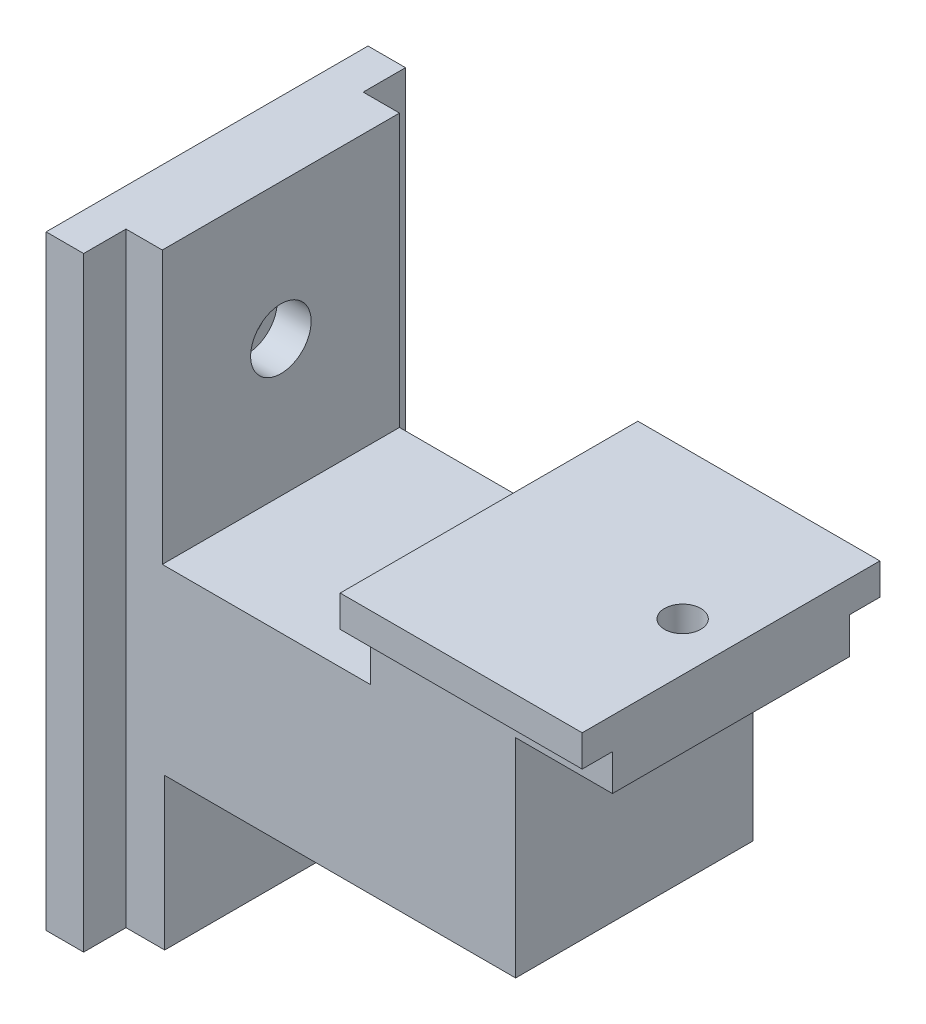
ISO-10303-21;
HEADER;
FILE_DESCRIPTION(('STEP AP214'),'2;1');
FILE_NAME('part.step','',(''),(''),'','','');
FILE_SCHEMA(('AUTOMOTIVE_DESIGN { 1 0 10303 214 1 1 1 1 }'));
ENDSEC;
DATA;
#1=APPLICATION_CONTEXT('core data for automotive mechanical design processes');
#2=APPLICATION_PROTOCOL_DEFINITION('international standard','automotive_design',2000,#1);
#3=PRODUCT_CONTEXT('',#1,'mechanical');
#4=PRODUCT('Part','Part','',(#3));
#5=PRODUCT_RELATED_PRODUCT_CATEGORY('part','',(#4));
#6=PRODUCT_DEFINITION_FORMATION('','',#4);
#7=PRODUCT_DEFINITION_CONTEXT('part definition',#1,'design');
#8=PRODUCT_DEFINITION('design','',#6,#7);
#9=PRODUCT_DEFINITION_SHAPE('','',#8);
#10=(LENGTH_UNIT() NAMED_UNIT(*) SI_UNIT(.MILLI.,.METRE.));
#11=(NAMED_UNIT(*) PLANE_ANGLE_UNIT() SI_UNIT($,.RADIAN.));
#12=(NAMED_UNIT(*) SI_UNIT($,.STERADIAN.) SOLID_ANGLE_UNIT());
#13=UNCERTAINTY_MEASURE_WITH_UNIT(LENGTH_MEASURE(1.E-05),#10,'distance_accuracy_value','');
#14=(GEOMETRIC_REPRESENTATION_CONTEXT(3) GLOBAL_UNCERTAINTY_ASSIGNED_CONTEXT((#13)) GLOBAL_UNIT_ASSIGNED_CONTEXT((#10,
#11,#12)) REPRESENTATION_CONTEXT('',''));
#15=CARTESIAN_POINT('',(0.,0.,0.));
#16=DIRECTION('',(0.,0.,1.));
#17=DIRECTION('',(1.,0.,0.));
#18=AXIS2_PLACEMENT_3D('',#15,#16,#17);
#19=CARTESIAN_POINT('',(-39.7426406871193,18.75,0.));
#20=DIRECTION('',(1.,0.,0.));
#21=DIRECTION('',(0.,0.,-1.));
#22=AXIS2_PLACEMENT_3D('',#19,#20,#21);
#23=CYLINDRICAL_SURFACE('',#22,1.5);
#24=CARTESIAN_POINT('',(-35.3,18.75,0.));
#25=DIRECTION('',(-1.,0.,0.));
#26=DIRECTION('',(0.,0.,1.));
#27=AXIS2_PLACEMENT_3D('',#24,#25,#26);
#28=CIRCLE('',#27,1.5);
#29=CARTESIAN_POINT('',(-35.3,18.75,1.50000000000001));
#30=VERTEX_POINT('',#29);
#31=EDGE_CURVE('E44',#30,#30,#28,.F.);
#32=ORIENTED_EDGE('',*,*,#31,.F.);
#33=EDGE_LOOP('',(#32));
#34=FACE_BOUND('',#33,.T.);
#35=CARTESIAN_POINT('',(-32.,18.75,0.));
#36=DIRECTION('',(1.,0.,0.));
#37=DIRECTION('',(0.,0.,-1.));
#38=AXIS2_PLACEMENT_3D('',#35,#36,#37);
#39=CIRCLE('',#38,1.5);
#40=CARTESIAN_POINT('',(-32.,18.75,-1.5));
#41=VERTEX_POINT('',#40);
#42=EDGE_CURVE('E207',#41,#41,#39,.T.);
#43=ORIENTED_EDGE('',*,*,#42,.T.);
#44=EDGE_LOOP('',(#43));
#45=FACE_BOUND('',#44,.T.);
#46=ADVANCED_FACE('F40',(#34,#45),#23,.F.);
#47=CARTESIAN_POINT('',(4.00000000000001,30.,0.));
#48=DIRECTION('',(0.,-1.,0.));
#49=DIRECTION('',(1.,0.,0.));
#50=AXIS2_PLACEMENT_3D('',#47,#48,#49);
#51=CYLINDRICAL_SURFACE('',#50,1.5);
#52=CARTESIAN_POINT('',(4.,15.3,0.));
#53=DIRECTION('',(0.,1.,0.));
#54=DIRECTION('',(-1.,0.,0.));
#55=AXIS2_PLACEMENT_3D('',#52,#53,#54);
#56=CIRCLE('',#55,1.5);
#57=CARTESIAN_POINT('',(2.5,15.3,0.));
#58=VERTEX_POINT('',#57);
#59=EDGE_CURVE('E208',#58,#58,#56,.T.);
#60=ORIENTED_EDGE('',*,*,#59,.T.);
#61=EDGE_LOOP('',(#60));
#62=FACE_BOUND('',#61,.T.);
#63=CARTESIAN_POINT('',(4.,11.5,0.));
#64=DIRECTION('',(0.,-1.,0.));
#65=DIRECTION('',(1.,0.,0.));
#66=AXIS2_PLACEMENT_3D('',#63,#64,#65);
#67=CIRCLE('',#66,1.5);
#68=CARTESIAN_POINT('',(5.5,11.5,0.));
#69=VERTEX_POINT('',#68);
#70=EDGE_CURVE('E223',#69,#69,#67,.T.);
#71=ORIENTED_EDGE('',*,*,#70,.T.);
#72=EDGE_LOOP('',(#71));
#73=FACE_BOUND('',#72,.T.);
#74=ADVANCED_FACE('F382',(#62,#73),#51,.F.);
#75=CARTESIAN_POINT('',(0.,12.5,10.));
#76=DIRECTION('',(-1.,0.,0.));
#77=DIRECTION('',(0.,-1.,0.));
#78=AXIS2_PLACEMENT_3D('',#75,#76,#77);
#79=PLANE('',#78);
#80=DIRECTION('',(0.,0.,-1.));
#81=VECTOR('',#80,1.);
#82=CARTESIAN_POINT('',(0.,9.7,10.));
#83=LINE('',#82,#81);
#84=CARTESIAN_POINT('',(0.,9.7,9.8));
#85=VERTEX_POINT('',#84);
#86=CARTESIAN_POINT('',(0.,9.7,-9.8));
#87=VERTEX_POINT('',#86);
#88=EDGE_CURVE('E210',#85,#87,#83,.T.);
#89=ORIENTED_EDGE('',*,*,#88,.F.);
#90=DIRECTION('',(0.,1.,0.));
#91=VECTOR('',#90,1.);
#92=CARTESIAN_POINT('',(0.,0.,9.8));
#93=LINE('',#92,#91);
#94=CARTESIAN_POINT('',(0.,-7.5,9.8));
#95=VERTEX_POINT('',#94);
#96=EDGE_CURVE('E258',#95,#85,#93,.T.);
#97=ORIENTED_EDGE('',*,*,#96,.F.);
#98=DIRECTION('',(0.,0.,-1.));
#99=VECTOR('',#98,1.);
#100=CARTESIAN_POINT('',(0.,-7.5,10.));
#101=LINE('',#100,#99);
#102=CARTESIAN_POINT('',(0.,-7.5,-9.8));
#103=VERTEX_POINT('',#102);
#104=EDGE_CURVE('E50',#95,#103,#101,.T.);
#105=ORIENTED_EDGE('',*,*,#104,.T.);
#106=DIRECTION('',(0.,1.,0.));
#107=VECTOR('',#106,1.);
#108=CARTESIAN_POINT('',(0.,0.,-9.8));
#109=LINE('',#108,#107);
#110=EDGE_CURVE('E189',#103,#87,#109,.T.);
#111=ORIENTED_EDGE('',*,*,#110,.T.);
#112=EDGE_LOOP('',(#89,#97,#105,#111));
#113=FACE_BOUND('',#112,.T.);
#114=ADVANCED_FACE('F388',(#113),#79,.F.);
#115=CARTESIAN_POINT('',(0.,12.7,0.));
#116=DIRECTION('',(0.,1.,0.));
#117=DIRECTION('',(-1.,0.,0.));
#118=AXIS2_PLACEMENT_3D('',#115,#116,#117);
#119=PLANE('',#118);
#120=DIRECTION('',(0.,0.,-1.));
#121=VECTOR('',#120,1.);
#122=CARTESIAN_POINT('',(7.99999999999999,12.7,12.5));
#123=LINE('',#122,#121);
#124=CARTESIAN_POINT('',(7.99999999999999,12.7,-9.8));
#125=VERTEX_POINT('',#124);
#126=CARTESIAN_POINT('',(7.99999999999999,12.7,-12.3));
#127=VERTEX_POINT('',#126);
#128=EDGE_CURVE('E188',#125,#127,#123,.T.);
#129=ORIENTED_EDGE('',*,*,#128,.F.);
#130=DIRECTION('',(-1.,0.,0.));
#131=VECTOR('',#130,1.);
#132=CARTESIAN_POINT('',(0.,12.7,-9.8));
#133=LINE('',#132,#131);
#134=CARTESIAN_POINT('',(-12.,12.7,-9.8));
#135=VERTEX_POINT('',#134);
#136=EDGE_CURVE('E59',#125,#135,#133,.T.);
#137=ORIENTED_EDGE('',*,*,#136,.T.);
#138=DIRECTION('',(0.,0.,1.));
#139=VECTOR('',#138,1.);
#140=CARTESIAN_POINT('',(-12.,12.7,10.));
#141=LINE('',#140,#139);
#142=CARTESIAN_POINT('',(-12.,12.7,-12.3));
#143=VERTEX_POINT('',#142);
#144=EDGE_CURVE('E187',#143,#135,#141,.T.);
#145=ORIENTED_EDGE('',*,*,#144,.F.);
#146=DIRECTION('',(-1.,0.,0.));
#147=VECTOR('',#146,1.);
#148=CARTESIAN_POINT('',(7.99999999999999,12.7,-12.3));
#149=LINE('',#148,#147);
#150=EDGE_CURVE('E266',#127,#143,#149,.T.);
#151=ORIENTED_EDGE('',*,*,#150,.F.);
#152=EDGE_LOOP('',(#129,#137,#145,#151));
#153=FACE_BOUND('',#152,.T.);
#154=ADVANCED_FACE('F185',(#153),#119,.F.);
#155=DIRECTION('',(-1.,0.,0.));
#156=VECTOR('',#155,1.);
#157=CARTESIAN_POINT('',(0.,12.7,9.8));
#158=LINE('',#157,#156);
#159=CARTESIAN_POINT('',(7.99999999999999,12.7,9.8));
#160=VERTEX_POINT('',#159);
#161=CARTESIAN_POINT('',(-12.,12.7,9.8));
#162=VERTEX_POINT('',#161);
#163=EDGE_CURVE('E256',#160,#162,#158,.T.);
#164=ORIENTED_EDGE('',*,*,#163,.F.);
#165=DIRECTION('',(0.,0.,-1.));
#166=VECTOR('',#165,1.);
#167=CARTESIAN_POINT('',(7.99999999999999,12.7,12.5));
#168=LINE('',#167,#166);
#169=CARTESIAN_POINT('',(7.99999999999999,12.7,12.3));
#170=VERTEX_POINT('',#169);
#171=EDGE_CURVE('E268',#170,#160,#168,.T.);
#172=ORIENTED_EDGE('',*,*,#171,.F.);
#173=DIRECTION('',(1.,0.,0.));
#174=VECTOR('',#173,1.);
#175=CARTESIAN_POINT('',(7.99999999999999,12.7,12.3));
#176=LINE('',#175,#174);
#177=CARTESIAN_POINT('',(-12.,12.7,12.3));
#178=VERTEX_POINT('',#177);
#179=EDGE_CURVE('E196',#178,#170,#176,.T.);
#180=ORIENTED_EDGE('',*,*,#179,.F.);
#181=DIRECTION('',(0.,0.,1.));
#182=VECTOR('',#181,1.);
#183=CARTESIAN_POINT('',(-12.,12.7,10.));
#184=LINE('',#183,#182);
#185=EDGE_CURVE('E197',#162,#178,#184,.T.);
#186=ORIENTED_EDGE('',*,*,#185,.F.);
#187=EDGE_LOOP('',(#164,#172,#180,#186));
#188=FACE_BOUND('',#187,.T.);
#189=ADVANCED_FACE('F430',(#188),#119,.F.);
#190=CARTESIAN_POINT('',(-12.,7.5,10.));
#191=DIRECTION('',(1.,0.,0.));
#192=DIRECTION('',(0.,1.,0.));
#193=AXIS2_PLACEMENT_3D('',#190,#191,#192);
#194=PLANE('',#193);
#195=DIRECTION('',(0.,-1.,0.));
#196=VECTOR('',#195,1.);
#197=CARTESIAN_POINT('',(-12.,0.,-9.8));
#198=LINE('',#197,#196);
#199=CARTESIAN_POINT('',(-12.,7.5,-9.8));
#200=VERTEX_POINT('',#199);
#201=EDGE_CURVE('E173',#135,#200,#198,.T.);
#202=ORIENTED_EDGE('',*,*,#201,.T.);
#203=DIRECTION('',(0.,0.,-1.));
#204=VECTOR('',#203,1.);
#205=CARTESIAN_POINT('',(-12.,7.5,10.));
#206=LINE('',#205,#204);
#207=CARTESIAN_POINT('',(-12.,7.5,9.8));
#208=VERTEX_POINT('',#207);
#209=EDGE_CURVE('E12',#208,#200,#206,.T.);
#210=ORIENTED_EDGE('',*,*,#209,.F.);
#211=DIRECTION('',(0.,-1.,0.));
#212=VECTOR('',#211,1.);
#213=CARTESIAN_POINT('',(-12.,0.,9.8));
#214=LINE('',#213,#212);
#215=EDGE_CURVE('E257',#162,#208,#214,.T.);
#216=ORIENTED_EDGE('',*,*,#215,.F.);
#217=ORIENTED_EDGE('',*,*,#185,.T.);
#218=DIRECTION('',(0.,-1.,0.));
#219=VECTOR('',#218,1.);
#220=CARTESIAN_POINT('',(-12.,15.5,12.3));
#221=LINE('',#220,#219);
#222=CARTESIAN_POINT('',(-12.,15.3,12.3));
#223=VERTEX_POINT('',#222);
#224=EDGE_CURVE('E288',#223,#178,#221,.T.);
#225=ORIENTED_EDGE('',*,*,#224,.F.);
#226=DIRECTION('',(0.,0.,1.));
#227=VECTOR('',#226,1.);
#228=CARTESIAN_POINT('',(-12.,15.3,10.));
#229=LINE('',#228,#227);
#230=CARTESIAN_POINT('',(-12.,15.3,-12.3));
#231=VERTEX_POINT('',#230);
#232=EDGE_CURVE('E263',#231,#223,#229,.T.);
#233=ORIENTED_EDGE('',*,*,#232,.F.);
#234=DIRECTION('',(0.,-1.,0.));
#235=VECTOR('',#234,1.);
#236=CARTESIAN_POINT('',(-12.,7.5,-12.3));
#237=LINE('',#236,#235);
#238=EDGE_CURVE('E195',#231,#143,#237,.T.);
#239=ORIENTED_EDGE('',*,*,#238,.T.);
#240=ORIENTED_EDGE('',*,*,#144,.T.);
#241=EDGE_LOOP('',(#202,#210,#216,#217,#225,#233,#239,#240));
#242=FACE_BOUND('',#241,.T.);
#243=ADVANCED_FACE('F192',(#242),#194,.F.);
#244=CARTESIAN_POINT('',(-32.,7.50000000000001,10.));
#245=DIRECTION('',(0.,-1.,0.));
#246=DIRECTION('',(1.,0.,0.));
#247=AXIS2_PLACEMENT_3D('',#244,#245,#246);
#248=PLANE('',#247);
#249=DIRECTION('',(-1.,0.,0.));
#250=VECTOR('',#249,1.);
#251=CARTESIAN_POINT('',(0.,7.5,-9.8));
#252=LINE('',#251,#250);
#253=CARTESIAN_POINT('',(-29.2,7.5,-9.8));
#254=VERTEX_POINT('',#253);
#255=EDGE_CURVE('E177',#200,#254,#252,.T.);
#256=ORIENTED_EDGE('',*,*,#255,.T.);
#257=DIRECTION('',(0.,0.,1.));
#258=VECTOR('',#257,1.);
#259=CARTESIAN_POINT('',(-29.2,7.5,10.));
#260=LINE('',#259,#258);
#261=CARTESIAN_POINT('',(-29.2,7.5,9.8));
#262=VERTEX_POINT('',#261);
#263=EDGE_CURVE('E235',#254,#262,#260,.T.);
#264=ORIENTED_EDGE('',*,*,#263,.T.);
#265=DIRECTION('',(-1.,0.,0.));
#266=VECTOR('',#265,1.);
#267=CARTESIAN_POINT('',(0.,7.5,9.8));
#268=LINE('',#267,#266);
#269=EDGE_CURVE('E255',#208,#262,#268,.T.);
#270=ORIENTED_EDGE('',*,*,#269,.F.);
#271=ORIENTED_EDGE('',*,*,#209,.T.);
#272=EDGE_LOOP('',(#256,#264,#270,#271));
#273=FACE_BOUND('',#272,.T.);
#274=ADVANCED_FACE('F423',(#273),#248,.F.);
#275=CARTESIAN_POINT('',(0.,-7.5,10.));
#276=DIRECTION('',(0.,1.,0.));
#277=DIRECTION('',(-1.,0.,0.));
#278=AXIS2_PLACEMENT_3D('',#275,#276,#277);
#279=PLANE('',#278);
#280=DIRECTION('',(1.,0.,0.));
#281=VECTOR('',#280,1.);
#282=CARTESIAN_POINT('',(0.,-7.5,9.8));
#283=LINE('',#282,#281);
#284=CARTESIAN_POINT('',(-29.,-7.5,9.8));
#285=VERTEX_POINT('',#284);
#286=EDGE_CURVE('E238',#285,#95,#283,.T.);
#287=ORIENTED_EDGE('',*,*,#286,.F.);
#288=DIRECTION('',(0.,0.,-1.));
#289=VECTOR('',#288,1.);
#290=CARTESIAN_POINT('',(-29.,-7.5,10.));
#291=LINE('',#290,#289);
#292=CARTESIAN_POINT('',(-29.,-7.5,-9.8));
#293=VERTEX_POINT('',#292);
#294=EDGE_CURVE('E233',#285,#293,#291,.T.);
#295=ORIENTED_EDGE('',*,*,#294,.T.);
#296=DIRECTION('',(1.,0.,0.));
#297=VECTOR('',#296,1.);
#298=CARTESIAN_POINT('',(0.,-7.5,-9.8));
#299=LINE('',#298,#297);
#300=EDGE_CURVE('E246',#293,#103,#299,.T.);
#301=ORIENTED_EDGE('',*,*,#300,.T.);
#302=ORIENTED_EDGE('',*,*,#104,.F.);
#303=EDGE_LOOP('',(#287,#295,#301,#302));
#304=FACE_BOUND('',#303,.T.);
#305=ADVANCED_FACE('F419',(#304),#279,.F.);
#306=CARTESIAN_POINT('',(0.,0.,9.8));
#307=DIRECTION('',(0.,0.,-1.));
#308=DIRECTION('',(-1.,0.,0.));
#309=AXIS2_PLACEMENT_3D('',#306,#307,#308);
#310=PLANE('',#309);
#311=ORIENTED_EDGE('',*,*,#269,.T.);
#312=DIRECTION('',(0.,1.,0.));
#313=VECTOR('',#312,1.);
#314=CARTESIAN_POINT('',(-29.2,-20.,9.8));
#315=LINE('',#314,#313);
#316=CARTESIAN_POINT('',(-29.2,30.,9.8));
#317=VERTEX_POINT('',#316);
#318=EDGE_CURVE('E250',#262,#317,#315,.T.);
#319=ORIENTED_EDGE('',*,*,#318,.T.);
#320=DIRECTION('',(1.,0.,0.));
#321=VECTOR('',#320,1.);
#322=CARTESIAN_POINT('',(0.,30.,9.8));
#323=LINE('',#322,#321);
#324=CARTESIAN_POINT('',(-32.2,30.,9.8));
#325=VERTEX_POINT('',#324);
#326=EDGE_CURVE('E341',#325,#317,#323,.T.);
#327=ORIENTED_EDGE('',*,*,#326,.F.);
#328=DIRECTION('',(0.,-1.,0.));
#329=VECTOR('',#328,1.);
#330=CARTESIAN_POINT('',(-32.2,0.,9.8));
#331=LINE('',#330,#329);
#332=CARTESIAN_POINT('',(-32.2,-20.,9.8));
#333=VERTEX_POINT('',#332);
#334=EDGE_CURVE('E253',#325,#333,#331,.T.);
#335=ORIENTED_EDGE('',*,*,#334,.T.);
#336=DIRECTION('',(1.,0.,0.));
#337=VECTOR('',#336,1.);
#338=CARTESIAN_POINT('',(0.,-20.,9.8));
#339=LINE('',#338,#337);
#340=CARTESIAN_POINT('',(-29.,-20.,9.8));
#341=VERTEX_POINT('',#340);
#342=EDGE_CURVE('E232',#333,#341,#339,.T.);
#343=ORIENTED_EDGE('',*,*,#342,.T.);
#344=DIRECTION('',(0.,1.,0.));
#345=VECTOR('',#344,1.);
#346=CARTESIAN_POINT('',(-29.,-20.,9.8));
#347=LINE('',#346,#345);
#348=EDGE_CURVE('E248',#341,#285,#347,.T.);
#349=ORIENTED_EDGE('',*,*,#348,.T.);
#350=ORIENTED_EDGE('',*,*,#286,.T.);
#351=ORIENTED_EDGE('',*,*,#96,.T.);
#352=DIRECTION('',(-1.,0.,0.));
#353=VECTOR('',#352,1.);
#354=CARTESIAN_POINT('',(28.2237484161567,9.69999999999998,9.8));
#355=LINE('',#354,#353);
#356=CARTESIAN_POINT('',(7.99999999999998,9.7,9.8));
#357=VERTEX_POINT('',#356);
#358=EDGE_CURVE('E241',#357,#85,#355,.T.);
#359=ORIENTED_EDGE('',*,*,#358,.F.);
#360=DIRECTION('',(0.,1.,0.));
#361=VECTOR('',#360,1.);
#362=CARTESIAN_POINT('',(7.99999999999998,0.,9.8));
#363=LINE('',#362,#361);
#364=EDGE_CURVE('E200',#357,#160,#363,.T.);
#365=ORIENTED_EDGE('',*,*,#364,.T.);
#366=ORIENTED_EDGE('',*,*,#163,.T.);
#367=ORIENTED_EDGE('',*,*,#215,.T.);
#368=EDGE_LOOP('',(#311,#319,#327,#335,#343,#349,#350,#351,#359,#365,#366,#367));
#369=FACE_BOUND('',#368,.T.);
#370=ADVANCED_FACE('F422',(#369),#310,.F.);
#371=CARTESIAN_POINT('',(0.,0.,-9.8));
#372=DIRECTION('',(0.,0.,-1.));
#373=DIRECTION('',(-1.,0.,0.));
#374=AXIS2_PLACEMENT_3D('',#371,#372,#373);
#375=PLANE('',#374);
#376=ORIENTED_EDGE('',*,*,#300,.F.);
#377=DIRECTION('',(0.,1.,0.));
#378=VECTOR('',#377,1.);
#379=CARTESIAN_POINT('',(-29.,-20.,-9.8));
#380=LINE('',#379,#378);
#381=CARTESIAN_POINT('',(-29.,-20.,-9.8));
#382=VERTEX_POINT('',#381);
#383=EDGE_CURVE('E236',#382,#293,#380,.T.);
#384=ORIENTED_EDGE('',*,*,#383,.F.);
#385=DIRECTION('',(-1.,0.,0.));
#386=VECTOR('',#385,1.);
#387=CARTESIAN_POINT('',(0.,-20.,-9.8));
#388=LINE('',#387,#386);
#389=CARTESIAN_POINT('',(-32.2,-20.,-9.8));
#390=VERTEX_POINT('',#389);
#391=EDGE_CURVE('E231',#382,#390,#388,.T.);
#392=ORIENTED_EDGE('',*,*,#391,.T.);
#393=DIRECTION('',(0.,-1.,0.));
#394=VECTOR('',#393,1.);
#395=CARTESIAN_POINT('',(-32.2,0.,-9.8));
#396=LINE('',#395,#394);
#397=CARTESIAN_POINT('',(-32.2,30.,-9.8));
#398=VERTEX_POINT('',#397);
#399=EDGE_CURVE('E244',#398,#390,#396,.T.);
#400=ORIENTED_EDGE('',*,*,#399,.F.);
#401=DIRECTION('',(-1.,0.,0.));
#402=VECTOR('',#401,1.);
#403=CARTESIAN_POINT('',(0.,30.,-9.8));
#404=LINE('',#403,#402);
#405=CARTESIAN_POINT('',(-29.2,30.,-9.8));
#406=VERTEX_POINT('',#405);
#407=EDGE_CURVE('E315',#406,#398,#404,.T.);
#408=ORIENTED_EDGE('',*,*,#407,.F.);
#409=DIRECTION('',(0.,1.,0.));
#410=VECTOR('',#409,1.);
#411=CARTESIAN_POINT('',(-29.2,-20.,-9.8));
#412=LINE('',#411,#410);
#413=EDGE_CURVE('E247',#254,#406,#412,.T.);
#414=ORIENTED_EDGE('',*,*,#413,.F.);
#415=ORIENTED_EDGE('',*,*,#255,.F.);
#416=ORIENTED_EDGE('',*,*,#201,.F.);
#417=ORIENTED_EDGE('',*,*,#136,.F.);
#418=DIRECTION('',(0.,-1.,0.));
#419=VECTOR('',#418,1.);
#420=CARTESIAN_POINT('',(7.99999999999999,15.5,-9.8));
#421=LINE('',#420,#419);
#422=CARTESIAN_POINT('',(7.99999999999998,9.7,-9.8));
#423=VERTEX_POINT('',#422);
#424=EDGE_CURVE('E243',#125,#423,#421,.T.);
#425=ORIENTED_EDGE('',*,*,#424,.T.);
#426=DIRECTION('',(-1.,0.,0.));
#427=VECTOR('',#426,1.);
#428=CARTESIAN_POINT('',(28.2237484161567,9.69999999999998,-9.8));
#429=LINE('',#428,#427);
#430=EDGE_CURVE('E215',#423,#87,#429,.T.);
#431=ORIENTED_EDGE('',*,*,#430,.T.);
#432=ORIENTED_EDGE('',*,*,#110,.F.);
#433=EDGE_LOOP('',(#376,#384,#392,#400,#408,#414,#415,#416,#417,#425,#431,#432));
#434=FACE_BOUND('',#433,.T.);
#435=ADVANCED_FACE('F175',(#434),#375,.T.);
#436=CARTESIAN_POINT('',(-29.2,-20.,-10.));
#437=DIRECTION('',(1.,0.,0.));
#438=DIRECTION('',(0.,0.,-1.));
#439=AXIS2_PLACEMENT_3D('',#436,#437,#438);
#440=PLANE('',#439);
#441=CARTESIAN_POINT('',(-29.2,18.75,0.));
#442=DIRECTION('',(1.,0.,0.));
#443=DIRECTION('',(0.,0.,-1.));
#444=AXIS2_PLACEMENT_3D('',#441,#442,#443);
#445=CIRCLE('',#444,2.5);
#446=CARTESIAN_POINT('',(-29.2,18.75,-2.49999999999999));
#447=VERTEX_POINT('',#446);
#448=EDGE_CURVE('E205',#447,#447,#445,.T.);
#449=ORIENTED_EDGE('',*,*,#448,.F.);
#450=EDGE_LOOP('',(#449));
#451=FACE_BOUND('',#450,.T.);
#452=ORIENTED_EDGE('',*,*,#263,.F.);
#453=ORIENTED_EDGE('',*,*,#413,.T.);
#454=DIRECTION('',(0.,0.,-1.));
#455=VECTOR('',#454,1.);
#456=CARTESIAN_POINT('',(-29.2,30.,0.));
#457=LINE('',#456,#455);
#458=EDGE_CURVE('E325',#317,#406,#457,.T.);
#459=ORIENTED_EDGE('',*,*,#458,.F.);
#460=ORIENTED_EDGE('',*,*,#318,.F.);
#461=EDGE_LOOP('',(#452,#453,#459,#460));
#462=FACE_BOUND('',#461,.T.);
#463=ADVANCED_FACE('F417',(#451,#462),#440,.T.);
#464=CARTESIAN_POINT('',(-29.,-20.,-10.));
#465=DIRECTION('',(1.,0.,0.));
#466=DIRECTION('',(0.,0.,-1.));
#467=AXIS2_PLACEMENT_3D('',#464,#465,#466);
#468=PLANE('',#467);
#469=ORIENTED_EDGE('',*,*,#294,.F.);
#470=ORIENTED_EDGE('',*,*,#348,.F.);
#471=DIRECTION('',(0.,0.,-1.));
#472=VECTOR('',#471,1.);
#473=CARTESIAN_POINT('',(-29.,-20.,-10.));
#474=LINE('',#473,#472);
#475=EDGE_CURVE('E228',#341,#382,#474,.T.);
#476=ORIENTED_EDGE('',*,*,#475,.T.);
#477=ORIENTED_EDGE('',*,*,#383,.T.);
#478=EDGE_LOOP('',(#469,#470,#476,#477));
#479=FACE_BOUND('',#478,.T.);
#480=ADVANCED_FACE('F413',(#479),#468,.T.);
#481=CARTESIAN_POINT('',(-32.2,-20.,-10.));
#482=DIRECTION('',(1.,0.,0.));
#483=DIRECTION('',(0.,0.,-1.));
#484=AXIS2_PLACEMENT_3D('',#481,#482,#483);
#485=PLANE('',#484);
#486=DIRECTION('',(0.,1.,0.));
#487=VECTOR('',#486,1.);
#488=CARTESIAN_POINT('',(-32.2,-20.,-13.3));
#489=LINE('',#488,#487);
#490=CARTESIAN_POINT('',(-32.2,-20.,-13.3));
#491=VERTEX_POINT('',#490);
#492=CARTESIAN_POINT('',(-32.2,30.,-13.3));
#493=VERTEX_POINT('',#492);
#494=EDGE_CURVE('E274',#491,#493,#489,.T.);
#495=ORIENTED_EDGE('',*,*,#494,.T.);
#496=DIRECTION('',(0.,0.,-1.));
#497=VECTOR('',#496,1.);
#498=CARTESIAN_POINT('',(-32.2,30.,0.));
#499=LINE('',#498,#497);
#500=EDGE_CURVE('E326',#398,#493,#499,.T.);
#501=ORIENTED_EDGE('',*,*,#500,.F.);
#502=ORIENTED_EDGE('',*,*,#399,.T.);
#503=DIRECTION('',(0.,0.,-1.));
#504=VECTOR('',#503,1.);
#505=CARTESIAN_POINT('',(-32.2,-20.,0.));
#506=LINE('',#505,#504);
#507=EDGE_CURVE('E312',#390,#491,#506,.T.);
#508=ORIENTED_EDGE('',*,*,#507,.T.);
#509=EDGE_LOOP('',(#495,#501,#502,#508));
#510=FACE_BOUND('',#509,.T.);
#511=ADVANCED_FACE('F416',(#510),#485,.T.);
#512=CARTESIAN_POINT('',(-32.2,-20.,13.5));
#513=DIRECTION('',(1.,0.,0.));
#514=DIRECTION('',(0.,0.,-1.));
#515=AXIS2_PLACEMENT_3D('',#512,#513,#514);
#516=PLANE('',#515);
#517=DIRECTION('',(0.,0.,-1.));
#518=VECTOR('',#517,1.);
#519=CARTESIAN_POINT('',(-32.2,-20.,0.));
#520=LINE('',#519,#518);
#521=CARTESIAN_POINT('',(-32.2,-20.,13.3));
#522=VERTEX_POINT('',#521);
#523=EDGE_CURVE('E300',#522,#333,#520,.T.);
#524=ORIENTED_EDGE('',*,*,#523,.T.);
#525=ORIENTED_EDGE('',*,*,#334,.F.);
#526=DIRECTION('',(0.,0.,-1.));
#527=VECTOR('',#526,1.);
#528=CARTESIAN_POINT('',(-32.2,30.,0.));
#529=LINE('',#528,#527);
#530=CARTESIAN_POINT('',(-32.2,30.,13.3));
#531=VERTEX_POINT('',#530);
#532=EDGE_CURVE('E338',#531,#325,#529,.T.);
#533=ORIENTED_EDGE('',*,*,#532,.F.);
#534=DIRECTION('',(0.,1.,0.));
#535=VECTOR('',#534,1.);
#536=CARTESIAN_POINT('',(-32.2,-20.,13.3));
#537=LINE('',#536,#535);
#538=EDGE_CURVE('E252',#522,#531,#537,.T.);
#539=ORIENTED_EDGE('',*,*,#538,.F.);
#540=EDGE_LOOP('',(#524,#525,#533,#539));
#541=FACE_BOUND('',#540,.T.);
#542=ADVANCED_FACE('F464',(#541),#516,.T.);
#543=CARTESIAN_POINT('',(-35.5,-20.,13.3));
#544=DIRECTION('',(0.,0.,1.));
#545=DIRECTION('',(1.,0.,0.));
#546=AXIS2_PLACEMENT_3D('',#543,#544,#545);
#547=PLANE('',#546);
#548=ORIENTED_EDGE('',*,*,#538,.T.);
#549=DIRECTION('',(1.,0.,0.));
#550=VECTOR('',#549,1.);
#551=CARTESIAN_POINT('',(0.,30.,13.3));
#552=LINE('',#551,#550);
#553=CARTESIAN_POINT('',(-35.3,30.,13.3));
#554=VERTEX_POINT('',#553);
#555=EDGE_CURVE('E335',#554,#531,#552,.T.);
#556=ORIENTED_EDGE('',*,*,#555,.F.);
#557=DIRECTION('',(0.,1.,0.));
#558=VECTOR('',#557,1.);
#559=CARTESIAN_POINT('',(-35.3,-20.,13.3));
#560=LINE('',#559,#558);
#561=CARTESIAN_POINT('',(-35.3,-20.,13.3));
#562=VERTEX_POINT('',#561);
#563=EDGE_CURVE('E270',#562,#554,#560,.T.);
#564=ORIENTED_EDGE('',*,*,#563,.F.);
#565=DIRECTION('',(1.,0.,0.));
#566=VECTOR('',#565,1.);
#567=CARTESIAN_POINT('',(0.,-20.,13.3));
#568=LINE('',#567,#566);
#569=EDGE_CURVE('E303',#562,#522,#568,.T.);
#570=ORIENTED_EDGE('',*,*,#569,.T.);
#571=EDGE_LOOP('',(#548,#556,#564,#570));
#572=FACE_BOUND('',#571,.T.);
#573=ADVANCED_FACE('F42',(#572),#547,.T.);
#574=CARTESIAN_POINT('',(-35.3,-20.,-13.5));
#575=DIRECTION('',(-1.,0.,0.));
#576=DIRECTION('',(0.,0.,1.));
#577=AXIS2_PLACEMENT_3D('',#574,#575,#576);
#578=PLANE('',#577);
#579=ORIENTED_EDGE('',*,*,#31,.T.);
#580=EDGE_LOOP('',(#579));
#581=FACE_BOUND('',#580,.T.);
#582=ORIENTED_EDGE('',*,*,#563,.T.);
#583=DIRECTION('',(0.,0.,1.));
#584=VECTOR('',#583,1.);
#585=CARTESIAN_POINT('',(-35.3,30.,0.));
#586=LINE('',#585,#584);
#587=CARTESIAN_POINT('',(-35.3,30.,-13.3));
#588=VERTEX_POINT('',#587);
#589=EDGE_CURVE('E332',#588,#554,#586,.T.);
#590=ORIENTED_EDGE('',*,*,#589,.F.);
#591=DIRECTION('',(0.,1.,0.));
#592=VECTOR('',#591,1.);
#593=CARTESIAN_POINT('',(-35.3,-20.,-13.3));
#594=LINE('',#593,#592);
#595=CARTESIAN_POINT('',(-35.3,-20.,-13.3));
#596=VERTEX_POINT('',#595);
#597=EDGE_CURVE('E272',#596,#588,#594,.T.);
#598=ORIENTED_EDGE('',*,*,#597,.F.);
#599=DIRECTION('',(0.,0.,1.));
#600=VECTOR('',#599,1.);
#601=CARTESIAN_POINT('',(-35.3,-20.,0.));
#602=LINE('',#601,#600);
#603=EDGE_CURVE('E306',#596,#562,#602,.T.);
#604=ORIENTED_EDGE('',*,*,#603,.T.);
#605=EDGE_LOOP('',(#582,#590,#598,#604));
#606=FACE_BOUND('',#605,.T.);
#607=ADVANCED_FACE('F471',(#581,#606),#578,.T.);
#608=CARTESIAN_POINT('',(-32.,-20.,-13.3));
#609=DIRECTION('',(0.,0.,-1.));
#610=DIRECTION('',(-1.,0.,0.));
#611=AXIS2_PLACEMENT_3D('',#608,#609,#610);
#612=PLANE('',#611);
#613=ORIENTED_EDGE('',*,*,#597,.T.);
#614=DIRECTION('',(-1.,0.,0.));
#615=VECTOR('',#614,1.);
#616=CARTESIAN_POINT('',(0.,30.,-13.3));
#617=LINE('',#616,#615);
#618=EDGE_CURVE('E329',#493,#588,#617,.T.);
#619=ORIENTED_EDGE('',*,*,#618,.F.);
#620=ORIENTED_EDGE('',*,*,#494,.F.);
#621=DIRECTION('',(-1.,0.,0.));
#622=VECTOR('',#621,1.);
#623=CARTESIAN_POINT('',(0.,-20.,-13.3));
#624=LINE('',#623,#622);
#625=EDGE_CURVE('E309',#491,#596,#624,.T.);
#626=ORIENTED_EDGE('',*,*,#625,.T.);
#627=EDGE_LOOP('',(#613,#619,#620,#626));
#628=FACE_BOUND('',#627,.T.);
#629=ADVANCED_FACE('F411',(#628),#612,.T.);
#630=CARTESIAN_POINT('',(0.,-20.,0.));
#631=DIRECTION('',(0.,1.,0.));
#632=DIRECTION('',(0.,0.,1.));
#633=AXIS2_PLACEMENT_3D('',#630,#631,#632);
#634=PLANE('',#633);
#635=ORIENTED_EDGE('',*,*,#507,.F.);
#636=ORIENTED_EDGE('',*,*,#391,.F.);
#637=ORIENTED_EDGE('',*,*,#475,.F.);
#638=ORIENTED_EDGE('',*,*,#342,.F.);
#639=ORIENTED_EDGE('',*,*,#523,.F.);
#640=ORIENTED_EDGE('',*,*,#569,.F.);
#641=ORIENTED_EDGE('',*,*,#603,.F.);
#642=ORIENTED_EDGE('',*,*,#625,.F.);
#643=EDGE_LOOP('',(#635,#636,#637,#638,#639,#640,#641,#642));
#644=FACE_BOUND('',#643,.T.);
#645=ADVANCED_FACE('F407',(#644),#634,.F.);
#646=CARTESIAN_POINT('',(0.,30.,0.));
#647=DIRECTION('',(0.,1.,0.));
#648=DIRECTION('',(0.,0.,1.));
#649=AXIS2_PLACEMENT_3D('',#646,#647,#648);
#650=PLANE('',#649);
#651=ORIENTED_EDGE('',*,*,#500,.T.);
#652=ORIENTED_EDGE('',*,*,#618,.T.);
#653=ORIENTED_EDGE('',*,*,#589,.T.);
#654=ORIENTED_EDGE('',*,*,#555,.T.);
#655=ORIENTED_EDGE('',*,*,#532,.T.);
#656=ORIENTED_EDGE('',*,*,#326,.T.);
#657=ORIENTED_EDGE('',*,*,#458,.T.);
#658=ORIENTED_EDGE('',*,*,#407,.T.);
#659=EDGE_LOOP('',(#651,#652,#653,#654,#655,#656,#657,#658));
#660=FACE_BOUND('',#659,.T.);
#661=ADVANCED_FACE('F404',(#660),#650,.T.);
#662=CARTESIAN_POINT('',(7.99999999999999,15.5,12.3));
#663=DIRECTION('',(0.,0.,-1.));
#664=DIRECTION('',(-1.,0.,0.));
#665=AXIS2_PLACEMENT_3D('',#662,#663,#664);
#666=PLANE('',#665);
#667=ORIENTED_EDGE('',*,*,#179,.T.);
#668=DIRECTION('',(0.,-1.,0.));
#669=VECTOR('',#668,1.);
#670=CARTESIAN_POINT('',(7.99999999999999,15.5,12.3));
#671=LINE('',#670,#669);
#672=CARTESIAN_POINT('',(7.99999999999999,15.3,12.3));
#673=VERTEX_POINT('',#672);
#674=EDGE_CURVE('E284',#673,#170,#671,.T.);
#675=ORIENTED_EDGE('',*,*,#674,.F.);
#676=DIRECTION('',(1.,0.,0.));
#677=VECTOR('',#676,1.);
#678=CARTESIAN_POINT('',(7.99999999999999,15.3,12.3));
#679=LINE('',#678,#677);
#680=EDGE_CURVE('E260',#223,#673,#679,.T.);
#681=ORIENTED_EDGE('',*,*,#680,.F.);
#682=ORIENTED_EDGE('',*,*,#224,.T.);
#683=EDGE_LOOP('',(#667,#675,#681,#682));
#684=FACE_BOUND('',#683,.T.);
#685=ADVANCED_FACE('F362',(#684),#666,.F.);
#686=CARTESIAN_POINT('',(7.99999999999999,15.5,12.5));
#687=DIRECTION('',(-1.,0.,0.));
#688=DIRECTION('',(0.,-1.,0.));
#689=AXIS2_PLACEMENT_3D('',#686,#687,#688);
#690=PLANE('',#689);
#691=ORIENTED_EDGE('',*,*,#171,.T.);
#692=ORIENTED_EDGE('',*,*,#364,.F.);
#693=DIRECTION('',(0.,0.,1.));
#694=VECTOR('',#693,1.);
#695=CARTESIAN_POINT('',(7.99999999999999,9.7,-10.));
#696=LINE('',#695,#694);
#697=EDGE_CURVE('E276',#423,#357,#696,.T.);
#698=ORIENTED_EDGE('',*,*,#697,.F.);
#699=ORIENTED_EDGE('',*,*,#424,.F.);
#700=ORIENTED_EDGE('',*,*,#128,.T.);
#701=DIRECTION('',(0.,-1.,0.));
#702=VECTOR('',#701,1.);
#703=CARTESIAN_POINT('',(7.99999999999999,15.5,-12.3));
#704=LINE('',#703,#702);
#705=CARTESIAN_POINT('',(7.99999999999999,15.3,-12.3));
#706=VERTEX_POINT('',#705);
#707=EDGE_CURVE('E281',#706,#127,#704,.T.);
#708=ORIENTED_EDGE('',*,*,#707,.F.);
#709=DIRECTION('',(0.,0.,-1.));
#710=VECTOR('',#709,1.);
#711=CARTESIAN_POINT('',(7.99999999999999,15.3,12.5));
#712=LINE('',#711,#710);
#713=EDGE_CURVE('E262',#673,#706,#712,.T.);
#714=ORIENTED_EDGE('',*,*,#713,.F.);
#715=ORIENTED_EDGE('',*,*,#674,.T.);
#716=EDGE_LOOP('',(#691,#692,#698,#699,#700,#708,#714,#715));
#717=FACE_BOUND('',#716,.T.);
#718=ADVANCED_FACE('F367',(#717),#690,.F.);
#719=CARTESIAN_POINT('',(7.99999999999999,15.5,-12.3));
#720=DIRECTION('',(0.,0.,1.));
#721=DIRECTION('',(1.,0.,0.));
#722=AXIS2_PLACEMENT_3D('',#719,#720,#721);
#723=PLANE('',#722);
#724=ORIENTED_EDGE('',*,*,#150,.T.);
#725=ORIENTED_EDGE('',*,*,#238,.F.);
#726=DIRECTION('',(-1.,0.,0.));
#727=VECTOR('',#726,1.);
#728=CARTESIAN_POINT('',(7.99999999999999,15.3,-12.3));
#729=LINE('',#728,#727);
#730=EDGE_CURVE('E264',#706,#231,#729,.T.);
#731=ORIENTED_EDGE('',*,*,#730,.F.);
#732=ORIENTED_EDGE('',*,*,#707,.T.);
#733=EDGE_LOOP('',(#724,#725,#731,#732));
#734=FACE_BOUND('',#733,.T.);
#735=ADVANCED_FACE('F369',(#734),#723,.F.);
#736=CARTESIAN_POINT('',(0.,15.3,0.));
#737=DIRECTION('',(0.,1.,0.));
#738=DIRECTION('',(-1.,0.,0.));
#739=AXIS2_PLACEMENT_3D('',#736,#737,#738);
#740=PLANE('',#739);
#741=ORIENTED_EDGE('',*,*,#59,.F.);
#742=EDGE_LOOP('',(#741));
#743=FACE_BOUND('',#742,.T.);
#744=ORIENTED_EDGE('',*,*,#232,.T.);
#745=ORIENTED_EDGE('',*,*,#680,.T.);
#746=ORIENTED_EDGE('',*,*,#713,.T.);
#747=ORIENTED_EDGE('',*,*,#730,.T.);
#748=EDGE_LOOP('',(#744,#745,#746,#747));
#749=FACE_BOUND('',#748,.T.);
#750=ADVANCED_FACE('F355',(#743,#749),#740,.T.);
#751=CARTESIAN_POINT('',(28.2237484161567,9.69999999999998,-10.));
#752=DIRECTION('',(0.,1.,0.));
#753=DIRECTION('',(-1.,0.,0.));
#754=AXIS2_PLACEMENT_3D('',#751,#752,#753);
#755=PLANE('',#754);
#756=CARTESIAN_POINT('',(4.,9.7,0.));
#757=DIRECTION('',(0.,1.,0.));
#758=DIRECTION('',(-1.,0.,0.));
#759=AXIS2_PLACEMENT_3D('',#756,#757,#758);
#760=CIRCLE('',#759,2.5);
#761=CARTESIAN_POINT('',(1.5,9.7,0.));
#762=VERTEX_POINT('',#761);
#763=EDGE_CURVE('E218',#762,#762,#760,.F.);
#764=ORIENTED_EDGE('',*,*,#763,.F.);
#765=EDGE_LOOP('',(#764));
#766=FACE_BOUND('',#765,.T.);
#767=ORIENTED_EDGE('',*,*,#430,.F.);
#768=ORIENTED_EDGE('',*,*,#697,.T.);
#769=ORIENTED_EDGE('',*,*,#358,.T.);
#770=ORIENTED_EDGE('',*,*,#88,.T.);
#771=EDGE_LOOP('',(#767,#768,#769,#770));
#772=FACE_BOUND('',#771,.T.);
#773=ADVANCED_FACE('F376',(#766,#772),#755,.F.);
#774=CARTESIAN_POINT('',(4.,11.5,0.));
#775=DIRECTION('',(0.,-1.,0.));
#776=DIRECTION('',(1.,0.,0.));
#777=AXIS2_PLACEMENT_3D('',#774,#775,#776);
#778=CYLINDRICAL_SURFACE('',#777,2.5);
#779=CARTESIAN_POINT('',(4.,11.5,0.));
#780=DIRECTION('',(0.,-1.,0.));
#781=DIRECTION('',(1.,0.,0.));
#782=AXIS2_PLACEMENT_3D('',#779,#780,#781);
#783=CIRCLE('',#782,2.5);
#784=CARTESIAN_POINT('',(6.5,11.5,0.));
#785=VERTEX_POINT('',#784);
#786=EDGE_CURVE('E211',#785,#785,#783,.T.);
#787=ORIENTED_EDGE('',*,*,#786,.F.);
#788=EDGE_LOOP('',(#787));
#789=FACE_BOUND('',#788,.T.);
#790=ORIENTED_EDGE('',*,*,#763,.T.);
#791=EDGE_LOOP('',(#790));
#792=FACE_BOUND('',#791,.T.);
#793=ADVANCED_FACE('F399',(#789,#792),#778,.F.);
#794=CARTESIAN_POINT('',(4.,11.5,0.));
#795=DIRECTION('',(0.,-1.,0.));
#796=DIRECTION('',(1.,0.,0.));
#797=AXIS2_PLACEMENT_3D('',#794,#795,#796);
#798=PLANE('',#797);
#799=ORIENTED_EDGE('',*,*,#70,.F.);
#800=EDGE_LOOP('',(#799));
#801=FACE_BOUND('',#800,.T.);
#802=ORIENTED_EDGE('',*,*,#786,.T.);
#803=EDGE_LOOP('',(#802));
#804=FACE_BOUND('',#803,.T.);
#805=ADVANCED_FACE('F396',(#801,#804),#798,.T.);
#806=CARTESIAN_POINT('',(-32.,18.75,0.));
#807=DIRECTION('',(1.,0.,0.));
#808=DIRECTION('',(0.,0.,-1.));
#809=AXIS2_PLACEMENT_3D('',#806,#807,#808);
#810=CYLINDRICAL_SURFACE('',#809,2.5);
#811=CARTESIAN_POINT('',(-32.,18.75,0.));
#812=DIRECTION('',(1.,0.,0.));
#813=DIRECTION('',(0.,0.,-1.));
#814=AXIS2_PLACEMENT_3D('',#811,#812,#813);
#815=CIRCLE('',#814,2.5);
#816=CARTESIAN_POINT('',(-32.,18.75,-2.49999999999999));
#817=VERTEX_POINT('',#816);
#818=EDGE_CURVE('E742',#817,#817,#815,.T.);
#819=ORIENTED_EDGE('',*,*,#818,.F.);
#820=EDGE_LOOP('',(#819));
#821=FACE_BOUND('',#820,.T.);
#822=ORIENTED_EDGE('',*,*,#448,.T.);
#823=EDGE_LOOP('',(#822));
#824=FACE_BOUND('',#823,.T.);
#825=ADVANCED_FACE('F394',(#821,#824),#810,.F.);
#826=CARTESIAN_POINT('',(-32.,0.,0.));
#827=DIRECTION('',(1.,0.,0.));
#828=DIRECTION('',(0.,0.,-1.));
#829=AXIS2_PLACEMENT_3D('',#826,#827,#828);
#830=PLANE('',#829);
#831=ORIENTED_EDGE('',*,*,#42,.F.);
#832=EDGE_LOOP('',(#831));
#833=FACE_BOUND('',#832,.T.);
#834=ORIENTED_EDGE('',*,*,#818,.T.);
#835=EDGE_LOOP('',(#834));
#836=FACE_BOUND('',#835,.T.);
#837=ADVANCED_FACE('F616',(#833,#836),#830,.T.);
#838=CLOSED_SHELL('',(#46,#74,#114,#154,#189,#243,#274,#305,#370,#435,#463,#480,#511,#542,#573,
#607,#629,#645,#661,#685,#718,#735,#750,#773,#793,#805,#825,#837));
#839=MANIFOLD_SOLID_BREP('B2',#838);
#840=ADVANCED_BREP_SHAPE_REPRESENTATION('',(#18,#839),#14);
#841=SHAPE_DEFINITION_REPRESENTATION(#9,#840);
ENDSEC;
END-ISO-10303-21;
